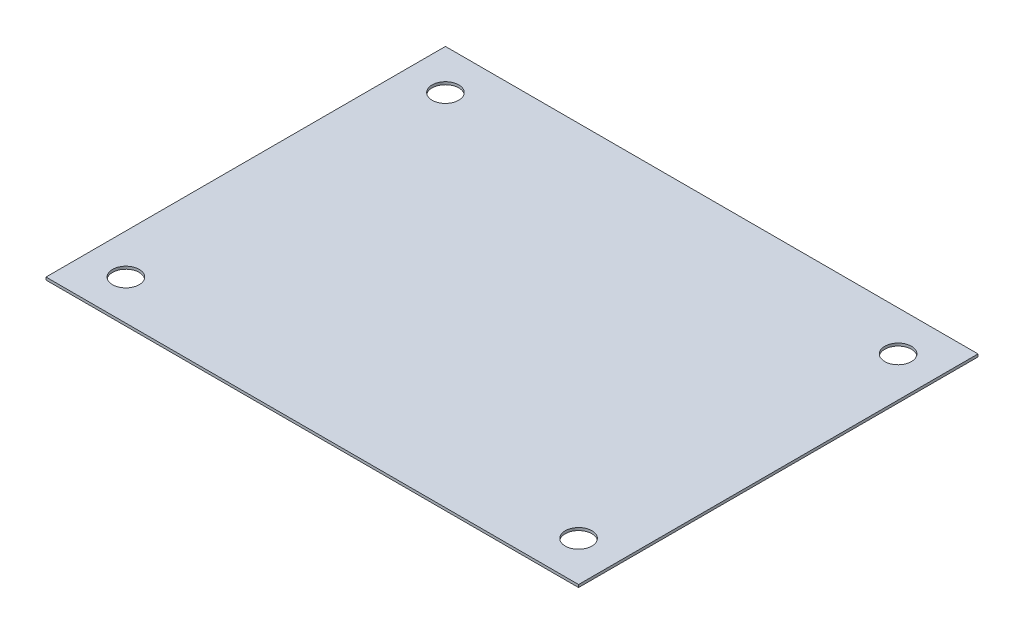
ISO-10303-21;
HEADER;
FILE_DESCRIPTION(('STEP AP214'),'2;1');
FILE_NAME('part.step','',(''),(''),'','','');
FILE_SCHEMA(('AUTOMOTIVE_DESIGN { 1 0 10303 214 1 1 1 1 }'));
ENDSEC;
DATA;
#1=APPLICATION_CONTEXT('core data for automotive mechanical design processes');
#2=APPLICATION_PROTOCOL_DEFINITION('international standard','automotive_design',2000,#1);
#3=PRODUCT_CONTEXT('',#1,'mechanical');
#4=PRODUCT('Part','Part','',(#3));
#5=PRODUCT_RELATED_PRODUCT_CATEGORY('part','',(#4));
#6=PRODUCT_DEFINITION_FORMATION('','',#4);
#7=PRODUCT_DEFINITION_CONTEXT('part definition',#1,'design');
#8=PRODUCT_DEFINITION('design','',#6,#7);
#9=PRODUCT_DEFINITION_SHAPE('','',#8);
#10=(LENGTH_UNIT() NAMED_UNIT(*) SI_UNIT(.MILLI.,.METRE.));
#11=(NAMED_UNIT(*) PLANE_ANGLE_UNIT() SI_UNIT($,.RADIAN.));
#12=(NAMED_UNIT(*) SI_UNIT($,.STERADIAN.) SOLID_ANGLE_UNIT());
#13=UNCERTAINTY_MEASURE_WITH_UNIT(LENGTH_MEASURE(1.E-05),#10,'distance_accuracy_value','');
#14=(GEOMETRIC_REPRESENTATION_CONTEXT(3) GLOBAL_UNCERTAINTY_ASSIGNED_CONTEXT((#13)) GLOBAL_UNIT_ASSIGNED_CONTEXT((#10,
#11,#12)) REPRESENTATION_CONTEXT('',''));
#15=CARTESIAN_POINT('',(0.,0.,0.));
#16=DIRECTION('',(0.,0.,1.));
#17=DIRECTION('',(1.,0.,0.));
#18=AXIS2_PLACEMENT_3D('',#15,#16,#17);
#19=CARTESIAN_POINT('',(0.,2.,0.));
#20=DIRECTION('',(0.,1.,0.));
#21=DIRECTION('',(0.,0.,1.));
#22=AXIS2_PLACEMENT_3D('',#19,#20,#21);
#23=PLANE('',#22);
#24=CARTESIAN_POINT('',(170.,2.,-120.));
#25=DIRECTION('',(0.,1.,0.));
#26=DIRECTION('',(0.,0.,-1.));
#27=AXIS2_PLACEMENT_3D('',#24,#25,#26);
#28=CIRCLE('',#27,10.);
#29=CARTESIAN_POINT('',(170.,2.,-130.));
#30=VERTEX_POINT('',#29);
#31=EDGE_CURVE('E122',#30,#30,#28,.T.);
#32=ORIENTED_EDGE('',*,*,#31,.F.);
#33=EDGE_LOOP('',(#32));
#34=FACE_BOUND('',#33,.T.);
#35=CARTESIAN_POINT('',(-170.,2.,-120.));
#36=DIRECTION('',(0.,1.,0.));
#37=DIRECTION('',(0.,0.,1.));
#38=AXIS2_PLACEMENT_3D('',#35,#36,#37);
#39=CIRCLE('',#38,10.);
#40=CARTESIAN_POINT('',(-170.,2.,-110.));
#41=VERTEX_POINT('',#40);
#42=EDGE_CURVE('E101',#41,#41,#39,.T.);
#43=ORIENTED_EDGE('',*,*,#42,.F.);
#44=EDGE_LOOP('',(#43));
#45=FACE_BOUND('',#44,.T.);
#46=DIRECTION('',(0.,0.,1.));
#47=VECTOR('',#46,1.);
#48=CARTESIAN_POINT('',(-200.,2.,-150.));
#49=LINE('',#48,#47);
#50=CARTESIAN_POINT('',(-200.,2.,-150.));
#51=VERTEX_POINT('',#50);
#52=CARTESIAN_POINT('',(-200.,2.,150.));
#53=VERTEX_POINT('',#52);
#54=EDGE_CURVE('E86',#51,#53,#49,.T.);
#55=ORIENTED_EDGE('',*,*,#54,.T.);
#56=DIRECTION('',(1.,0.,0.));
#57=VECTOR('',#56,1.);
#58=CARTESIAN_POINT('',(-200.,2.,150.));
#59=LINE('',#58,#57);
#60=CARTESIAN_POINT('',(200.,2.,150.));
#61=VERTEX_POINT('',#60);
#62=EDGE_CURVE('E81',#53,#61,#59,.T.);
#63=ORIENTED_EDGE('',*,*,#62,.T.);
#64=DIRECTION('',(0.,0.,-1.));
#65=VECTOR('',#64,1.);
#66=CARTESIAN_POINT('',(200.,2.,-150.));
#67=LINE('',#66,#65);
#68=CARTESIAN_POINT('',(200.,2.,-150.));
#69=VERTEX_POINT('',#68);
#70=EDGE_CURVE('E84',#61,#69,#67,.T.);
#71=ORIENTED_EDGE('',*,*,#70,.T.);
#72=DIRECTION('',(-1.,0.,0.));
#73=VECTOR('',#72,1.);
#74=CARTESIAN_POINT('',(-200.,2.,-150.));
#75=LINE('',#74,#73);
#76=EDGE_CURVE('E51',#69,#51,#75,.T.);
#77=ORIENTED_EDGE('',*,*,#76,.T.);
#78=EDGE_LOOP('',(#55,#63,#71,#77));
#79=FACE_BOUND('',#78,.T.);
#80=CARTESIAN_POINT('',(-170.,2.,120.));
#81=DIRECTION('',(0.,1.,0.));
#82=DIRECTION('',(0.,0.,-1.));
#83=AXIS2_PLACEMENT_3D('',#80,#81,#82);
#84=CIRCLE('',#83,10.);
#85=CARTESIAN_POINT('',(-170.,2.,110.));
#86=VERTEX_POINT('',#85);
#87=EDGE_CURVE('E116',#86,#86,#84,.T.);
#88=ORIENTED_EDGE('',*,*,#87,.F.);
#89=EDGE_LOOP('',(#88));
#90=FACE_BOUND('',#89,.T.);
#91=CARTESIAN_POINT('',(170.,2.,120.));
#92=DIRECTION('',(0.,1.,0.));
#93=DIRECTION('',(0.,0.,1.));
#94=AXIS2_PLACEMENT_3D('',#91,#92,#93);
#95=CIRCLE('',#94,10.);
#96=CARTESIAN_POINT('',(170.,2.,130.));
#97=VERTEX_POINT('',#96);
#98=EDGE_CURVE('E128',#97,#97,#95,.T.);
#99=ORIENTED_EDGE('',*,*,#98,.F.);
#100=EDGE_LOOP('',(#99));
#101=FACE_BOUND('',#100,.T.);
#102=ADVANCED_FACE('F34',(#34,#45,#79,#90,#101),#23,.T.);
#103=CARTESIAN_POINT('',(0.,0.,0.));
#104=DIRECTION('',(0.,1.,0.));
#105=DIRECTION('',(0.,0.,1.));
#106=AXIS2_PLACEMENT_3D('',#103,#104,#105);
#107=PLANE('',#106);
#108=DIRECTION('',(0.,0.,1.));
#109=VECTOR('',#108,1.);
#110=CARTESIAN_POINT('',(-200.,0.,-150.));
#111=LINE('',#110,#109);
#112=CARTESIAN_POINT('',(-200.,0.,-150.));
#113=VERTEX_POINT('',#112);
#114=CARTESIAN_POINT('',(-200.,0.,150.));
#115=VERTEX_POINT('',#114);
#116=EDGE_CURVE('E98',#113,#115,#111,.T.);
#117=ORIENTED_EDGE('',*,*,#116,.F.);
#118=DIRECTION('',(-1.,0.,0.));
#119=VECTOR('',#118,1.);
#120=CARTESIAN_POINT('',(-200.,0.,-150.));
#121=LINE('',#120,#119);
#122=CARTESIAN_POINT('',(200.,0.,-150.));
#123=VERTEX_POINT('',#122);
#124=EDGE_CURVE('E74',#123,#113,#121,.T.);
#125=ORIENTED_EDGE('',*,*,#124,.F.);
#126=DIRECTION('',(0.,0.,-1.));
#127=VECTOR('',#126,1.);
#128=CARTESIAN_POINT('',(200.,0.,-150.));
#129=LINE('',#128,#127);
#130=CARTESIAN_POINT('',(200.,0.,150.));
#131=VERTEX_POINT('',#130);
#132=EDGE_CURVE('E68',#131,#123,#129,.T.);
#133=ORIENTED_EDGE('',*,*,#132,.F.);
#134=DIRECTION('',(1.,0.,0.));
#135=VECTOR('',#134,1.);
#136=CARTESIAN_POINT('',(-200.,0.,150.));
#137=LINE('',#136,#135);
#138=EDGE_CURVE('E90',#115,#131,#137,.T.);
#139=ORIENTED_EDGE('',*,*,#138,.F.);
#140=EDGE_LOOP('',(#117,#125,#133,#139));
#141=FACE_BOUND('',#140,.T.);
#142=CARTESIAN_POINT('',(-170.,0.,-120.));
#143=DIRECTION('',(0.,1.,0.));
#144=DIRECTION('',(0.,0.,1.));
#145=AXIS2_PLACEMENT_3D('',#142,#143,#144);
#146=CIRCLE('',#145,10.);
#147=CARTESIAN_POINT('',(-170.,0.,-110.));
#148=VERTEX_POINT('',#147);
#149=EDGE_CURVE('E113',#148,#148,#146,.T.);
#150=ORIENTED_EDGE('',*,*,#149,.T.);
#151=EDGE_LOOP('',(#150));
#152=FACE_BOUND('',#151,.T.);
#153=CARTESIAN_POINT('',(-170.,0.,120.));
#154=DIRECTION('',(0.,1.,0.));
#155=DIRECTION('',(0.,0.,-1.));
#156=AXIS2_PLACEMENT_3D('',#153,#154,#155);
#157=CIRCLE('',#156,10.);
#158=CARTESIAN_POINT('',(-170.,0.,110.));
#159=VERTEX_POINT('',#158);
#160=EDGE_CURVE('E119',#159,#159,#157,.T.);
#161=ORIENTED_EDGE('',*,*,#160,.T.);
#162=EDGE_LOOP('',(#161));
#163=FACE_BOUND('',#162,.T.);
#164=CARTESIAN_POINT('',(170.,0.,-120.));
#165=DIRECTION('',(0.,1.,0.));
#166=DIRECTION('',(0.,0.,-1.));
#167=AXIS2_PLACEMENT_3D('',#164,#165,#166);
#168=CIRCLE('',#167,10.);
#169=CARTESIAN_POINT('',(170.,0.,-130.));
#170=VERTEX_POINT('',#169);
#171=EDGE_CURVE('E125',#170,#170,#168,.T.);
#172=ORIENTED_EDGE('',*,*,#171,.T.);
#173=EDGE_LOOP('',(#172));
#174=FACE_BOUND('',#173,.T.);
#175=CARTESIAN_POINT('',(170.,0.,120.));
#176=DIRECTION('',(0.,1.,0.));
#177=DIRECTION('',(0.,0.,1.));
#178=AXIS2_PLACEMENT_3D('',#175,#176,#177);
#179=CIRCLE('',#178,10.);
#180=CARTESIAN_POINT('',(170.,0.,130.));
#181=VERTEX_POINT('',#180);
#182=EDGE_CURVE('E131',#181,#181,#179,.T.);
#183=ORIENTED_EDGE('',*,*,#182,.T.);
#184=EDGE_LOOP('',(#183));
#185=FACE_BOUND('',#184,.T.);
#186=ADVANCED_FACE('F109',(#141,#152,#163,#174,#185),#107,.F.);
#187=CARTESIAN_POINT('',(-200.,2.,-150.));
#188=DIRECTION('',(1.,0.,0.));
#189=DIRECTION('',(0.,0.,-1.));
#190=AXIS2_PLACEMENT_3D('',#187,#188,#189);
#191=PLANE('',#190);
#192=ORIENTED_EDGE('',*,*,#116,.T.);
#193=DIRECTION('',(0.,-1.,0.));
#194=VECTOR('',#193,1.);
#195=CARTESIAN_POINT('',(-200.,2.,150.));
#196=LINE('',#195,#194);
#197=EDGE_CURVE('E11',#53,#115,#196,.T.);
#198=ORIENTED_EDGE('',*,*,#197,.F.);
#199=ORIENTED_EDGE('',*,*,#54,.F.);
#200=DIRECTION('',(0.,-1.,0.));
#201=VECTOR('',#200,1.);
#202=CARTESIAN_POINT('',(-200.,2.,-150.));
#203=LINE('',#202,#201);
#204=EDGE_CURVE('E94',#51,#113,#203,.T.);
#205=ORIENTED_EDGE('',*,*,#204,.T.);
#206=EDGE_LOOP('',(#192,#198,#199,#205));
#207=FACE_BOUND('',#206,.T.);
#208=ADVANCED_FACE('F36',(#207),#191,.F.);
#209=CARTESIAN_POINT('',(-200.,2.,150.));
#210=DIRECTION('',(0.,0.,-1.));
#211=DIRECTION('',(-1.,0.,0.));
#212=AXIS2_PLACEMENT_3D('',#209,#210,#211);
#213=PLANE('',#212);
#214=ORIENTED_EDGE('',*,*,#138,.T.);
#215=DIRECTION('',(0.,-1.,0.));
#216=VECTOR('',#215,1.);
#217=CARTESIAN_POINT('',(200.,2.,150.));
#218=LINE('',#217,#216);
#219=EDGE_CURVE('E43',#61,#131,#218,.T.);
#220=ORIENTED_EDGE('',*,*,#219,.F.);
#221=ORIENTED_EDGE('',*,*,#62,.F.);
#222=ORIENTED_EDGE('',*,*,#197,.T.);
#223=EDGE_LOOP('',(#214,#220,#221,#222));
#224=FACE_BOUND('',#223,.T.);
#225=ADVANCED_FACE('F89',(#224),#213,.F.);
#226=CARTESIAN_POINT('',(200.,2.,-150.));
#227=DIRECTION('',(-1.,0.,0.));
#228=DIRECTION('',(0.,0.,1.));
#229=AXIS2_PLACEMENT_3D('',#226,#227,#228);
#230=PLANE('',#229);
#231=ORIENTED_EDGE('',*,*,#132,.T.);
#232=DIRECTION('',(0.,-1.,0.));
#233=VECTOR('',#232,1.);
#234=CARTESIAN_POINT('',(200.,2.,-150.));
#235=LINE('',#234,#233);
#236=EDGE_CURVE('E91',#69,#123,#235,.T.);
#237=ORIENTED_EDGE('',*,*,#236,.F.);
#238=ORIENTED_EDGE('',*,*,#70,.F.);
#239=ORIENTED_EDGE('',*,*,#219,.T.);
#240=EDGE_LOOP('',(#231,#237,#238,#239));
#241=FACE_BOUND('',#240,.T.);
#242=ADVANCED_FACE('F92',(#241),#230,.F.);
#243=CARTESIAN_POINT('',(-200.,2.,-150.));
#244=DIRECTION('',(0.,0.,1.));
#245=DIRECTION('',(1.,0.,0.));
#246=AXIS2_PLACEMENT_3D('',#243,#244,#245);
#247=PLANE('',#246);
#248=ORIENTED_EDGE('',*,*,#124,.T.);
#249=ORIENTED_EDGE('',*,*,#204,.F.);
#250=ORIENTED_EDGE('',*,*,#76,.F.);
#251=ORIENTED_EDGE('',*,*,#236,.T.);
#252=EDGE_LOOP('',(#248,#249,#250,#251));
#253=FACE_BOUND('',#252,.T.);
#254=ADVANCED_FACE('F106',(#253),#247,.F.);
#255=CARTESIAN_POINT('',(-170.,2.,-120.));
#256=DIRECTION('',(0.,-1.,0.));
#257=DIRECTION('',(0.,0.,-1.));
#258=AXIS2_PLACEMENT_3D('',#255,#256,#257);
#259=CYLINDRICAL_SURFACE('',#258,10.);
#260=ORIENTED_EDGE('',*,*,#42,.T.);
#261=EDGE_LOOP('',(#260));
#262=FACE_BOUND('',#261,.T.);
#263=ORIENTED_EDGE('',*,*,#149,.F.);
#264=EDGE_LOOP('',(#263));
#265=FACE_BOUND('',#264,.T.);
#266=ADVANCED_FACE('F150',(#262,#265),#259,.F.);
#267=CARTESIAN_POINT('',(-170.,2.,120.));
#268=DIRECTION('',(0.,-1.,0.));
#269=DIRECTION('',(0.,0.,-1.));
#270=AXIS2_PLACEMENT_3D('',#267,#268,#269);
#271=CYLINDRICAL_SURFACE('',#270,10.);
#272=ORIENTED_EDGE('',*,*,#87,.T.);
#273=EDGE_LOOP('',(#272));
#274=FACE_BOUND('',#273,.T.);
#275=ORIENTED_EDGE('',*,*,#160,.F.);
#276=EDGE_LOOP('',(#275));
#277=FACE_BOUND('',#276,.T.);
#278=ADVANCED_FACE('F196',(#274,#277),#271,.F.);
#279=CARTESIAN_POINT('',(170.,2.,-120.));
#280=DIRECTION('',(0.,-1.,0.));
#281=DIRECTION('',(0.,0.,-1.));
#282=AXIS2_PLACEMENT_3D('',#279,#280,#281);
#283=CYLINDRICAL_SURFACE('',#282,10.);
#284=ORIENTED_EDGE('',*,*,#31,.T.);
#285=EDGE_LOOP('',(#284));
#286=FACE_BOUND('',#285,.T.);
#287=ORIENTED_EDGE('',*,*,#171,.F.);
#288=EDGE_LOOP('',(#287));
#289=FACE_BOUND('',#288,.T.);
#290=ADVANCED_FACE('F204',(#286,#289),#283,.F.);
#291=CARTESIAN_POINT('',(170.,2.,120.));
#292=DIRECTION('',(0.,-1.,0.));
#293=DIRECTION('',(0.,0.,-1.));
#294=AXIS2_PLACEMENT_3D('',#291,#292,#293);
#295=CYLINDRICAL_SURFACE('',#294,10.);
#296=ORIENTED_EDGE('',*,*,#98,.T.);
#297=EDGE_LOOP('',(#296));
#298=FACE_BOUND('',#297,.T.);
#299=ORIENTED_EDGE('',*,*,#182,.F.);
#300=EDGE_LOOP('',(#299));
#301=FACE_BOUND('',#300,.T.);
#302=ADVANCED_FACE('F137',(#298,#301),#295,.F.);
#303=CLOSED_SHELL('',(#102,#186,#208,#225,#242,#254,#266,#278,#290,#302));
#304=MANIFOLD_SOLID_BREP('B2',#303);
#305=ADVANCED_BREP_SHAPE_REPRESENTATION('',(#18,#304),#14);
#306=SHAPE_DEFINITION_REPRESENTATION(#9,#305);
ENDSEC;
END-ISO-10303-21;
